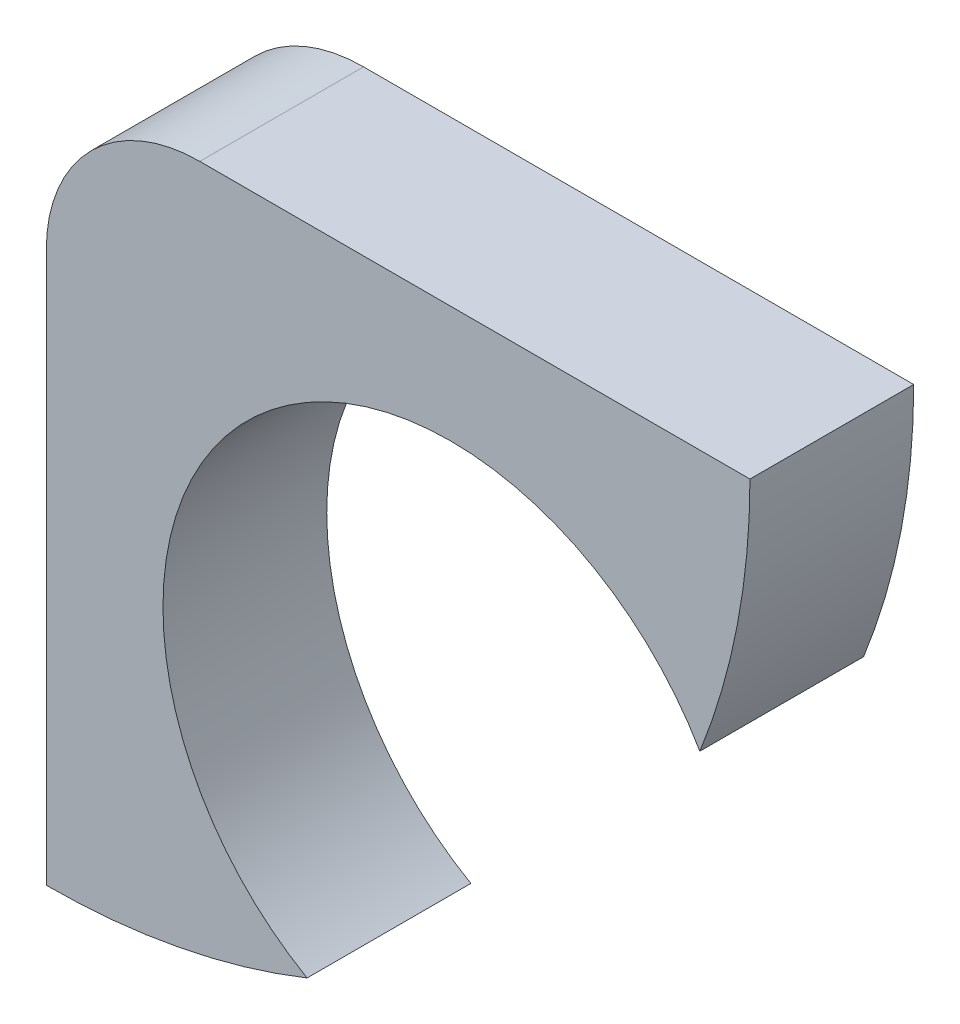
ISO-10303-21;
HEADER;
FILE_DESCRIPTION(('STEP AP214'),'2;1');
FILE_NAME('part.step','',(''),(''),'','','');
FILE_SCHEMA(('AUTOMOTIVE_DESIGN { 1 0 10303 214 1 1 1 1 }'));
ENDSEC;
DATA;
#1=APPLICATION_CONTEXT('core data for automotive mechanical design processes');
#2=APPLICATION_PROTOCOL_DEFINITION('international standard','automotive_design',2000,#1);
#3=PRODUCT_CONTEXT('',#1,'mechanical');
#4=PRODUCT('Part','Part','',(#3));
#5=PRODUCT_RELATED_PRODUCT_CATEGORY('part','',(#4));
#6=PRODUCT_DEFINITION_FORMATION('','',#4);
#7=PRODUCT_DEFINITION_CONTEXT('part definition',#1,'design');
#8=PRODUCT_DEFINITION('design','',#6,#7);
#9=PRODUCT_DEFINITION_SHAPE('','',#8);
#10=(LENGTH_UNIT() NAMED_UNIT(*) SI_UNIT(.MILLI.,.METRE.));
#11=(NAMED_UNIT(*) PLANE_ANGLE_UNIT() SI_UNIT($,.RADIAN.));
#12=(NAMED_UNIT(*) SI_UNIT($,.STERADIAN.) SOLID_ANGLE_UNIT());
#13=UNCERTAINTY_MEASURE_WITH_UNIT(LENGTH_MEASURE(1.E-05),#10,'distance_accuracy_value','');
#14=(GEOMETRIC_REPRESENTATION_CONTEXT(3) GLOBAL_UNCERTAINTY_ASSIGNED_CONTEXT((#13)) GLOBAL_UNIT_ASSIGNED_CONTEXT((#10,
#11,#12)) REPRESENTATION_CONTEXT('',''));
#15=CARTESIAN_POINT('',(0.,0.,0.));
#16=DIRECTION('',(0.,0.,1.));
#17=DIRECTION('',(1.,0.,0.));
#18=AXIS2_PLACEMENT_3D('',#15,#16,#17);
#19=CARTESIAN_POINT('',(-18.45,18.45,1.));
#20=DIRECTION('',(0.,0.,-1.));
#21=DIRECTION('',(0.,-1.,0.));
#22=AXIS2_PLACEMENT_3D('',#19,#20,#21);
#23=PLANE('',#22);
#24=CARTESIAN_POINT('',(-18.45,18.45,1.));
#25=DIRECTION('',(0.,0.,-1.));
#26=DIRECTION('',(-1.,0.,0.));
#27=AXIS2_PLACEMENT_3D('',#24,#25,#26);
#28=CIRCLE('',#27,1.5);
#29=CARTESIAN_POINT('',(-19.95,18.45,1.));
#30=VERTEX_POINT('',#29);
#31=CARTESIAN_POINT('',(-18.45,19.95,1.));
#32=VERTEX_POINT('',#31);
#33=EDGE_CURVE('E155',#30,#32,#28,.T.);
#34=ORIENTED_EDGE('',*,*,#33,.F.);
#35=DIRECTION('',(0.,1.,0.));
#36=VECTOR('',#35,1.);
#37=CARTESIAN_POINT('',(-19.95,13.075,1.));
#38=LINE('',#37,#36);
#39=CARTESIAN_POINT('',(-19.95,13.075,1.));
#40=VERTEX_POINT('',#39);
#41=EDGE_CURVE('E27',#40,#30,#38,.T.);
#42=ORIENTED_EDGE('',*,*,#41,.F.);
#43=CARTESIAN_POINT('',(-19.95,19.95,1.));
#44=DIRECTION('',(0.,0.,-1.));
#45=DIRECTION('',(-1.,0.,0.));
#46=AXIS2_PLACEMENT_3D('',#43,#44,#45);
#47=CIRCLE('',#46,6.875);
#48=CARTESIAN_POINT('',(-17.4018583423997,13.5646574803851,1.));
#49=VERTEX_POINT('',#48);
#50=EDGE_CURVE('E100',#49,#40,#47,.T.);
#51=ORIENTED_EDGE('',*,*,#50,.F.);
#52=CARTESIAN_POINT('',(-16.,16.,1.));
#53=DIRECTION('',(0.,0.,1.));
#54=DIRECTION('',(-1.,0.,0.));
#55=AXIS2_PLACEMENT_3D('',#52,#53,#54);
#56=CIRCLE('',#55,2.81);
#57=CARTESIAN_POINT('',(-13.5646574803851,17.4018583423997,1.));
#58=VERTEX_POINT('',#57);
#59=EDGE_CURVE('E20',#58,#49,#56,.T.);
#60=ORIENTED_EDGE('',*,*,#59,.F.);
#61=CARTESIAN_POINT('',(-19.95,19.95,1.));
#62=DIRECTION('',(0.,0.,-1.));
#63=DIRECTION('',(-1.,0.,0.));
#64=AXIS2_PLACEMENT_3D('',#61,#62,#63);
#65=CIRCLE('',#64,6.875);
#66=CARTESIAN_POINT('',(-13.075,19.95,1.));
#67=VERTEX_POINT('',#66);
#68=EDGE_CURVE('E87',#67,#58,#65,.T.);
#69=ORIENTED_EDGE('',*,*,#68,.F.);
#70=DIRECTION('',(1.,0.,0.));
#71=VECTOR('',#70,1.);
#72=CARTESIAN_POINT('',(-18.45,19.95,1.));
#73=LINE('',#72,#71);
#74=EDGE_CURVE('E157',#32,#67,#73,.T.);
#75=ORIENTED_EDGE('',*,*,#74,.F.);
#76=EDGE_LOOP('',(#34,#42,#51,#60,#69,#75));
#77=FACE_BOUND('',#76,.T.);
#78=ADVANCED_FACE('F16',(#77),#23,.F.);
#79=CARTESIAN_POINT('',(-18.45,18.45,-0.6));
#80=DIRECTION('',(0.,0.,-1.));
#81=DIRECTION('',(0.,-1.,0.));
#82=AXIS2_PLACEMENT_3D('',#79,#80,#81);
#83=PLANE('',#82);
#84=CARTESIAN_POINT('',(-18.45,18.45,-0.6));
#85=DIRECTION('',(0.,0.,-1.));
#86=DIRECTION('',(-1.,0.,0.));
#87=AXIS2_PLACEMENT_3D('',#84,#85,#86);
#88=CIRCLE('',#87,1.5);
#89=CARTESIAN_POINT('',(-19.95,18.45,-0.6));
#90=VERTEX_POINT('',#89);
#91=CARTESIAN_POINT('',(-18.45,19.95,-0.6));
#92=VERTEX_POINT('',#91);
#93=EDGE_CURVE('E132',#90,#92,#88,.T.);
#94=ORIENTED_EDGE('',*,*,#93,.T.);
#95=DIRECTION('',(1.,0.,0.));
#96=VECTOR('',#95,1.);
#97=CARTESIAN_POINT('',(-18.45,19.95,-0.6));
#98=LINE('',#97,#96);
#99=CARTESIAN_POINT('',(-13.075,19.95,-0.6));
#100=VERTEX_POINT('',#99);
#101=EDGE_CURVE('E136',#92,#100,#98,.T.);
#102=ORIENTED_EDGE('',*,*,#101,.T.);
#103=CARTESIAN_POINT('',(-19.95,19.95,-0.6));
#104=DIRECTION('',(0.,0.,-1.));
#105=DIRECTION('',(-1.,0.,0.));
#106=AXIS2_PLACEMENT_3D('',#103,#104,#105);
#107=CIRCLE('',#106,6.875);
#108=CARTESIAN_POINT('',(-13.5646574803851,17.4018583423997,-0.6));
#109=VERTEX_POINT('',#108);
#110=EDGE_CURVE('E79',#100,#109,#107,.T.);
#111=ORIENTED_EDGE('',*,*,#110,.T.);
#112=CARTESIAN_POINT('',(-16.,16.,-0.6));
#113=DIRECTION('',(0.,0.,1.));
#114=DIRECTION('',(-1.,0.,0.));
#115=AXIS2_PLACEMENT_3D('',#112,#113,#114);
#116=CIRCLE('',#115,2.81);
#117=CARTESIAN_POINT('',(-17.4018583423997,13.5646574803851,-0.6));
#118=VERTEX_POINT('',#117);
#119=EDGE_CURVE('E116',#109,#118,#116,.T.);
#120=ORIENTED_EDGE('',*,*,#119,.T.);
#121=CARTESIAN_POINT('',(-19.95,19.95,-0.6));
#122=DIRECTION('',(0.,0.,-1.));
#123=DIRECTION('',(-1.,0.,0.));
#124=AXIS2_PLACEMENT_3D('',#121,#122,#123);
#125=CIRCLE('',#124,6.875);
#126=CARTESIAN_POINT('',(-19.95,13.075,-0.6));
#127=VERTEX_POINT('',#126);
#128=EDGE_CURVE('E107',#118,#127,#125,.T.);
#129=ORIENTED_EDGE('',*,*,#128,.T.);
#130=DIRECTION('',(0.,1.,0.));
#131=VECTOR('',#130,1.);
#132=CARTESIAN_POINT('',(-19.95,13.075,-0.6));
#133=LINE('',#132,#131);
#134=EDGE_CURVE('E11',#127,#90,#133,.T.);
#135=ORIENTED_EDGE('',*,*,#134,.T.);
#136=EDGE_LOOP('',(#94,#102,#111,#120,#129,#135));
#137=FACE_BOUND('',#136,.T.);
#138=ADVANCED_FACE('F117',(#137),#83,.T.);
#139=CARTESIAN_POINT('',(-19.95,13.075,-0.6));
#140=DIRECTION('',(1.,0.,0.));
#141=DIRECTION('',(0.,1.,0.));
#142=AXIS2_PLACEMENT_3D('',#139,#140,#141);
#143=PLANE('',#142);
#144=ORIENTED_EDGE('',*,*,#41,.T.);
#145=DIRECTION('',(0.,0.,1.));
#146=VECTOR('',#145,1.);
#147=CARTESIAN_POINT('',(-19.95,18.45,-0.6));
#148=LINE('',#147,#146);
#149=EDGE_CURVE('E135',#90,#30,#148,.T.);
#150=ORIENTED_EDGE('',*,*,#149,.F.);
#151=ORIENTED_EDGE('',*,*,#134,.F.);
#152=DIRECTION('',(0.,0.,1.));
#153=VECTOR('',#152,1.);
#154=CARTESIAN_POINT('',(-19.95,13.075,-0.6));
#155=LINE('',#154,#153);
#156=EDGE_CURVE('E113',#127,#40,#155,.T.);
#157=ORIENTED_EDGE('',*,*,#156,.T.);
#158=EDGE_LOOP('',(#144,#150,#151,#157));
#159=FACE_BOUND('',#158,.T.);
#160=ADVANCED_FACE('F148',(#159),#143,.F.);
#161=CARTESIAN_POINT('',(-19.95,19.95,-0.6));
#162=DIRECTION('',(0.,0.,1.));
#163=DIRECTION('',(1.,0.,0.));
#164=AXIS2_PLACEMENT_3D('',#161,#162,#163);
#165=CYLINDRICAL_SURFACE('',#164,6.875);
#166=ORIENTED_EDGE('',*,*,#50,.T.);
#167=ORIENTED_EDGE('',*,*,#156,.F.);
#168=ORIENTED_EDGE('',*,*,#128,.F.);
#169=DIRECTION('',(0.,0.,1.));
#170=VECTOR('',#169,1.);
#171=CARTESIAN_POINT('',(-17.4018583423997,13.5646574803851,-0.6));
#172=LINE('',#171,#170);
#173=EDGE_CURVE('E111',#118,#49,#172,.T.);
#174=ORIENTED_EDGE('',*,*,#173,.T.);
#175=EDGE_LOOP('',(#166,#167,#168,#174));
#176=FACE_BOUND('',#175,.T.);
#177=ADVANCED_FACE('F109',(#176),#165,.T.);
#178=CARTESIAN_POINT('',(-16.,16.,-0.6));
#179=DIRECTION('',(0.,0.,1.));
#180=DIRECTION('',(1.,0.,0.));
#181=AXIS2_PLACEMENT_3D('',#178,#179,#180);
#182=CYLINDRICAL_SURFACE('',#181,2.81);
#183=ORIENTED_EDGE('',*,*,#59,.T.);
#184=ORIENTED_EDGE('',*,*,#173,.F.);
#185=ORIENTED_EDGE('',*,*,#119,.F.);
#186=DIRECTION('',(0.,0.,1.));
#187=VECTOR('',#186,1.);
#188=CARTESIAN_POINT('',(-13.5646574803851,17.4018583423997,-0.6));
#189=LINE('',#188,#187);
#190=EDGE_CURVE('E142',#109,#58,#189,.T.);
#191=ORIENTED_EDGE('',*,*,#190,.T.);
#192=EDGE_LOOP('',(#183,#184,#185,#191));
#193=FACE_BOUND('',#192,.T.);
#194=ADVANCED_FACE('F18',(#193),#182,.F.);
#195=CARTESIAN_POINT('',(-19.95,19.95,-0.6));
#196=DIRECTION('',(0.,0.,1.));
#197=DIRECTION('',(1.,0.,0.));
#198=AXIS2_PLACEMENT_3D('',#195,#196,#197);
#199=CYLINDRICAL_SURFACE('',#198,6.875);
#200=ORIENTED_EDGE('',*,*,#68,.T.);
#201=ORIENTED_EDGE('',*,*,#190,.F.);
#202=ORIENTED_EDGE('',*,*,#110,.F.);
#203=DIRECTION('',(0.,0.,1.));
#204=VECTOR('',#203,1.);
#205=CARTESIAN_POINT('',(-13.075,19.95,-0.6));
#206=LINE('',#205,#204);
#207=EDGE_CURVE('E138',#100,#67,#206,.T.);
#208=ORIENTED_EDGE('',*,*,#207,.T.);
#209=EDGE_LOOP('',(#200,#201,#202,#208));
#210=FACE_BOUND('',#209,.T.);
#211=ADVANCED_FACE('F312',(#210),#199,.T.);
#212=CARTESIAN_POINT('',(-18.45,19.95,-0.6));
#213=DIRECTION('',(0.,-1.,0.));
#214=DIRECTION('',(0.,0.,-1.));
#215=AXIS2_PLACEMENT_3D('',#212,#213,#214);
#216=PLANE('',#215);
#217=ORIENTED_EDGE('',*,*,#74,.T.);
#218=ORIENTED_EDGE('',*,*,#207,.F.);
#219=ORIENTED_EDGE('',*,*,#101,.F.);
#220=DIRECTION('',(0.,0.,1.));
#221=VECTOR('',#220,1.);
#222=CARTESIAN_POINT('',(-18.45,19.95,-0.6));
#223=LINE('',#222,#221);
#224=EDGE_CURVE('E130',#92,#32,#223,.T.);
#225=ORIENTED_EDGE('',*,*,#224,.T.);
#226=EDGE_LOOP('',(#217,#218,#219,#225));
#227=FACE_BOUND('',#226,.T.);
#228=ADVANCED_FACE('F301',(#227),#216,.F.);
#229=CARTESIAN_POINT('',(-18.45,18.45,-0.6));
#230=DIRECTION('',(0.,0.,1.));
#231=DIRECTION('',(1.,0.,0.));
#232=AXIS2_PLACEMENT_3D('',#229,#230,#231);
#233=CYLINDRICAL_SURFACE('',#232,1.5);
#234=ORIENTED_EDGE('',*,*,#33,.T.);
#235=ORIENTED_EDGE('',*,*,#224,.F.);
#236=ORIENTED_EDGE('',*,*,#93,.F.);
#237=ORIENTED_EDGE('',*,*,#149,.T.);
#238=EDGE_LOOP('',(#234,#235,#236,#237));
#239=FACE_BOUND('',#238,.T.);
#240=ADVANCED_FACE('F153',(#239),#233,.T.);
#241=CLOSED_SHELL('',(#78,#138,#160,#177,#194,#211,#228,#240));
#242=MANIFOLD_SOLID_BREP('B1',#241);
#243=ADVANCED_BREP_SHAPE_REPRESENTATION('',(#18,#242),#14);
#244=SHAPE_DEFINITION_REPRESENTATION(#9,#243);
ENDSEC;
END-ISO-10303-21;
